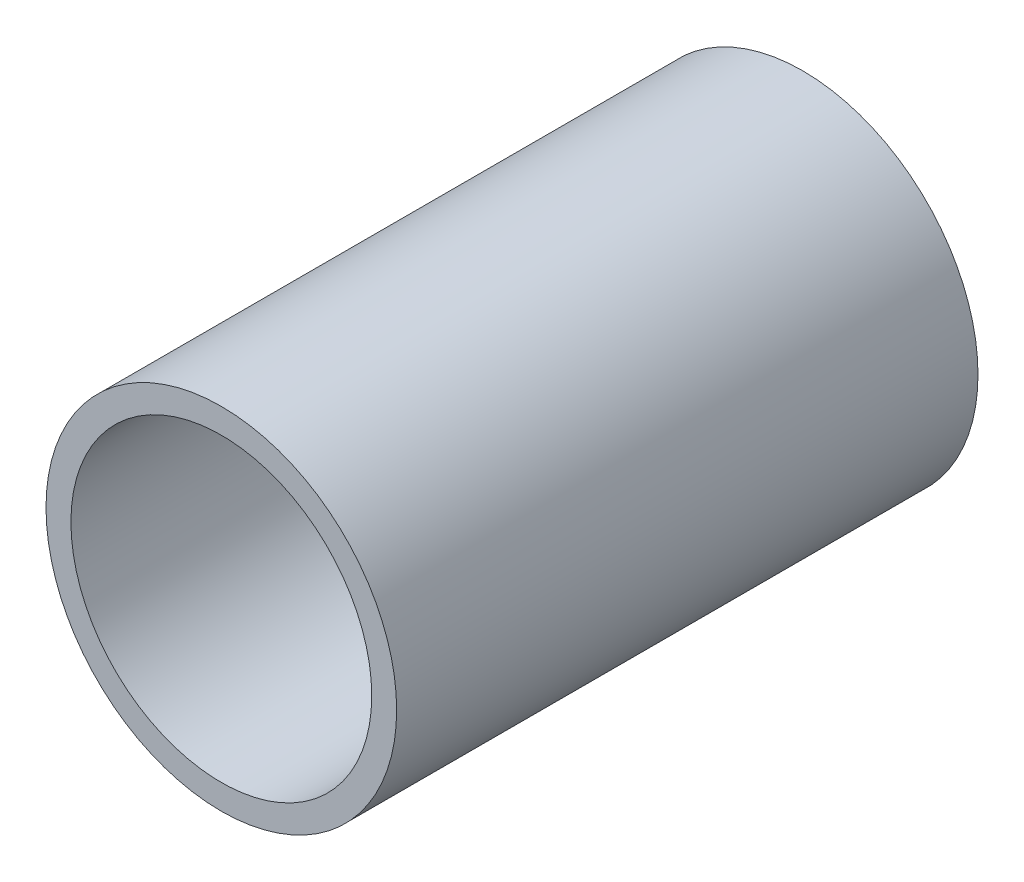
ISO-10303-21;
HEADER;
FILE_DESCRIPTION(('STEP AP214'),'2;1');
FILE_NAME('part.step','',(''),(''),'','','');
FILE_SCHEMA(('AUTOMOTIVE_DESIGN { 1 0 10303 214 1 1 1 1 }'));
ENDSEC;
DATA;
#1=APPLICATION_CONTEXT('core data for automotive mechanical design processes');
#2=APPLICATION_PROTOCOL_DEFINITION('international standard','automotive_design',2000,#1);
#3=PRODUCT_CONTEXT('',#1,'mechanical');
#4=PRODUCT('Part','Part','',(#3));
#5=PRODUCT_RELATED_PRODUCT_CATEGORY('part','',(#4));
#6=PRODUCT_DEFINITION_FORMATION('','',#4);
#7=PRODUCT_DEFINITION_CONTEXT('part definition',#1,'design');
#8=PRODUCT_DEFINITION('design','',#6,#7);
#9=PRODUCT_DEFINITION_SHAPE('','',#8);
#10=(LENGTH_UNIT() NAMED_UNIT(*) SI_UNIT(.MILLI.,.METRE.));
#11=(NAMED_UNIT(*) PLANE_ANGLE_UNIT() SI_UNIT($,.RADIAN.));
#12=(NAMED_UNIT(*) SI_UNIT($,.STERADIAN.) SOLID_ANGLE_UNIT());
#13=UNCERTAINTY_MEASURE_WITH_UNIT(LENGTH_MEASURE(1.E-05),#10,'distance_accuracy_value','');
#14=(GEOMETRIC_REPRESENTATION_CONTEXT(3) GLOBAL_UNCERTAINTY_ASSIGNED_CONTEXT((#13)) GLOBAL_UNIT_ASSIGNED_CONTEXT((#10,
#11,#12)) REPRESENTATION_CONTEXT('',''));
#15=CARTESIAN_POINT('',(0.,0.,0.));
#16=DIRECTION('',(0.,0.,1.));
#17=DIRECTION('',(1.,0.,0.));
#18=AXIS2_PLACEMENT_3D('',#15,#16,#17);
#19=CARTESIAN_POINT('',(0.,0.,31.5));
#20=DIRECTION('',(0.,0.,1.));
#21=DIRECTION('',(1.,0.,0.));
#22=AXIS2_PLACEMENT_3D('',#19,#20,#21);
#23=PLANE('',#22);
#24=CARTESIAN_POINT('',(0.,0.,31.5));
#25=DIRECTION('',(0.,0.,1.));
#26=DIRECTION('',(1.,0.,0.));
#27=AXIS2_PLACEMENT_3D('',#24,#25,#26);
#28=CIRCLE('',#27,9.5);
#29=CARTESIAN_POINT('',(9.5,0.,31.5));
#30=VERTEX_POINT('',#29);
#31=EDGE_CURVE('E10',#30,#30,#28,.T.);
#32=ORIENTED_EDGE('',*,*,#31,.T.);
#33=EDGE_LOOP('',(#32));
#34=FACE_BOUND('',#33,.T.);
#35=CARTESIAN_POINT('',(0.,0.,31.5));
#36=DIRECTION('',(0.,0.,1.));
#37=DIRECTION('',(1.,0.,0.));
#38=AXIS2_PLACEMENT_3D('',#35,#36,#37);
#39=CIRCLE('',#38,8.15);
#40=CARTESIAN_POINT('',(8.15,0.,31.5));
#41=VERTEX_POINT('',#40);
#42=EDGE_CURVE('E50',#41,#41,#39,.T.);
#43=ORIENTED_EDGE('',*,*,#42,.F.);
#44=EDGE_LOOP('',(#43));
#45=FACE_BOUND('',#44,.T.);
#46=ADVANCED_FACE('F37',(#34,#45),#23,.T.);
#47=CARTESIAN_POINT('',(0.,0.,0.));
#48=DIRECTION('',(0.,0.,1.));
#49=DIRECTION('',(1.,0.,0.));
#50=AXIS2_PLACEMENT_3D('',#47,#48,#49);
#51=PLANE('',#50);
#52=CARTESIAN_POINT('',(0.,0.,0.));
#53=DIRECTION('',(0.,0.,1.));
#54=DIRECTION('',(1.,0.,0.));
#55=AXIS2_PLACEMENT_3D('',#52,#53,#54);
#56=CIRCLE('',#55,9.5);
#57=CARTESIAN_POINT('',(9.5,0.,0.));
#58=VERTEX_POINT('',#57);
#59=EDGE_CURVE('E41',#58,#58,#56,.T.);
#60=ORIENTED_EDGE('',*,*,#59,.F.);
#61=EDGE_LOOP('',(#60));
#62=FACE_BOUND('',#61,.T.);
#63=CARTESIAN_POINT('',(0.,0.,0.));
#64=DIRECTION('',(0.,0.,1.));
#65=DIRECTION('',(1.,0.,0.));
#66=AXIS2_PLACEMENT_3D('',#63,#64,#65);
#67=CIRCLE('',#66,8.15);
#68=CARTESIAN_POINT('',(8.15,0.,0.));
#69=VERTEX_POINT('',#68);
#70=EDGE_CURVE('E52',#69,#69,#67,.T.);
#71=ORIENTED_EDGE('',*,*,#70,.T.);
#72=EDGE_LOOP('',(#71));
#73=FACE_BOUND('',#72,.T.);
#74=ADVANCED_FACE('F64',(#62,#73),#51,.F.);
#75=CARTESIAN_POINT('',(0.,0.,31.5));
#76=DIRECTION('',(0.,0.,-1.));
#77=DIRECTION('',(-1.,0.,0.));
#78=AXIS2_PLACEMENT_3D('',#75,#76,#77);
#79=CYLINDRICAL_SURFACE('',#78,9.5);
#80=ORIENTED_EDGE('',*,*,#31,.F.);
#81=EDGE_LOOP('',(#80));
#82=FACE_BOUND('',#81,.T.);
#83=ORIENTED_EDGE('',*,*,#59,.T.);
#84=EDGE_LOOP('',(#83));
#85=FACE_BOUND('',#84,.T.);
#86=ADVANCED_FACE('F39',(#82,#85),#79,.T.);
#87=CARTESIAN_POINT('',(0.,0.,31.5));
#88=DIRECTION('',(0.,0.,-1.));
#89=DIRECTION('',(-1.,0.,0.));
#90=AXIS2_PLACEMENT_3D('',#87,#88,#89);
#91=CYLINDRICAL_SURFACE('',#90,8.15);
#92=ORIENTED_EDGE('',*,*,#42,.T.);
#93=EDGE_LOOP('',(#92));
#94=FACE_BOUND('',#93,.T.);
#95=ORIENTED_EDGE('',*,*,#70,.F.);
#96=EDGE_LOOP('',(#95));
#97=FACE_BOUND('',#96,.T.);
#98=ADVANCED_FACE('F60',(#94,#97),#91,.F.);
#99=CLOSED_SHELL('',(#46,#74,#86,#98));
#100=MANIFOLD_SOLID_BREP('B2',#99);
#101=ADVANCED_BREP_SHAPE_REPRESENTATION('',(#18,#100),#14);
#102=SHAPE_DEFINITION_REPRESENTATION(#9,#101);
ENDSEC;
END-ISO-10303-21;
